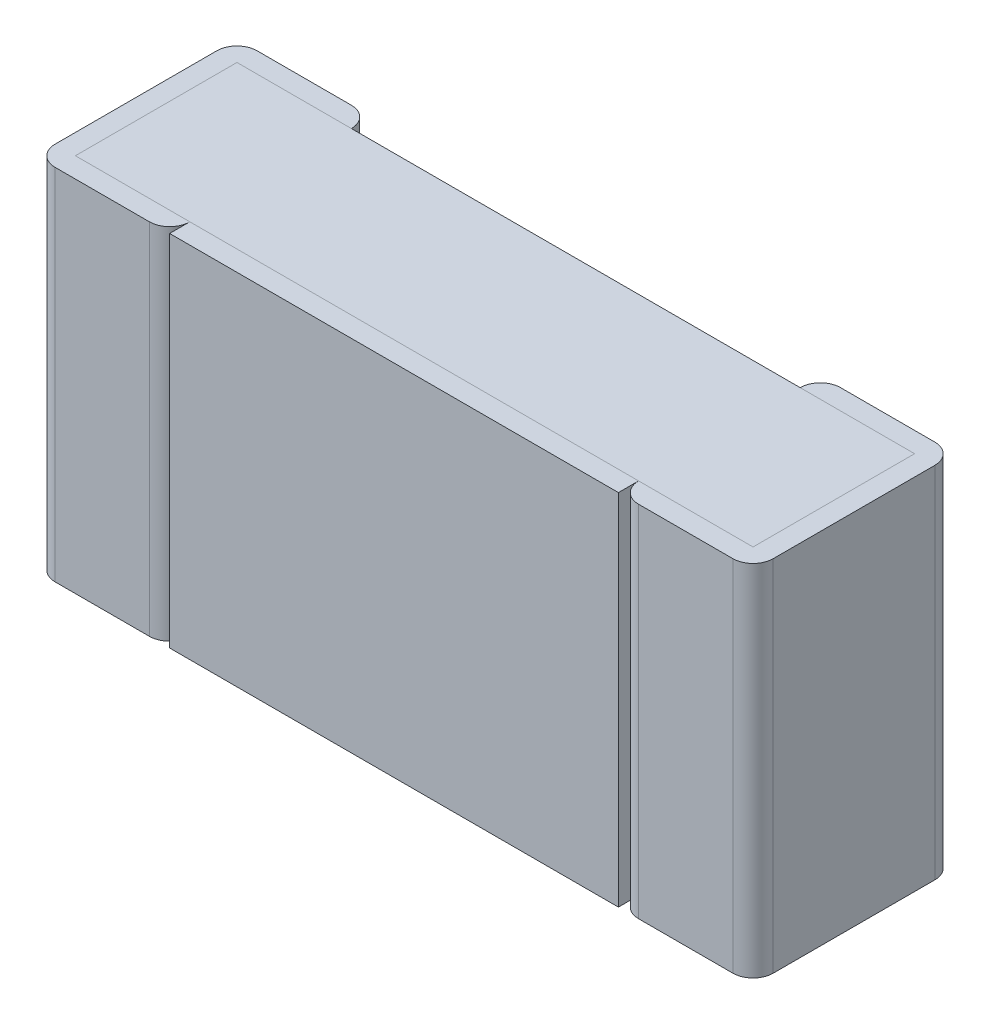
ISO-10303-21;
HEADER;
FILE_DESCRIPTION(('STEP AP214'),'2;1');
FILE_NAME('part.step','',(''),(''),'','','');
FILE_SCHEMA(('AUTOMOTIVE_DESIGN { 1 0 10303 214 1 1 1 1 }'));
ENDSEC;
DATA;
#1=APPLICATION_CONTEXT('core data for automotive mechanical design processes');
#2=APPLICATION_PROTOCOL_DEFINITION('international standard','automotive_design',2000,#1);
#3=PRODUCT_CONTEXT('',#1,'mechanical');
#4=PRODUCT('Part','Part','',(#3));
#5=PRODUCT_RELATED_PRODUCT_CATEGORY('part','',(#4));
#6=PRODUCT_DEFINITION_FORMATION('','',#4);
#7=PRODUCT_DEFINITION_CONTEXT('part definition',#1,'design');
#8=PRODUCT_DEFINITION('design','',#6,#7);
#9=PRODUCT_DEFINITION_SHAPE('','',#8);
#10=(LENGTH_UNIT() NAMED_UNIT(*) SI_UNIT(.MILLI.,.METRE.));
#11=(NAMED_UNIT(*) PLANE_ANGLE_UNIT() SI_UNIT($,.RADIAN.));
#12=(NAMED_UNIT(*) SI_UNIT($,.STERADIAN.) SOLID_ANGLE_UNIT());
#13=UNCERTAINTY_MEASURE_WITH_UNIT(LENGTH_MEASURE(1.E-05),#10,'distance_accuracy_value','');
#14=(GEOMETRIC_REPRESENTATION_CONTEXT(3) GLOBAL_UNCERTAINTY_ASSIGNED_CONTEXT((#13)) GLOBAL_UNIT_ASSIGNED_CONTEXT((#10,
#11,#12)) REPRESENTATION_CONTEXT('',''));
#15=CARTESIAN_POINT('',(0.,0.,0.));
#16=DIRECTION('',(0.,0.,1.));
#17=DIRECTION('',(1.,0.,0.));
#18=AXIS2_PLACEMENT_3D('',#15,#16,#17);
#19=CARTESIAN_POINT('',(136.568744279938,112.30804329235,112.661582908599));
#20=DIRECTION('',(0.,0.,1.));
#21=DIRECTION('',(1.,0.,0.));
#22=AXIS2_PLACEMENT_3D('',#19,#20,#21);
#23=PLANE('',#22);
#24=DIRECTION('',(0.,1.,0.));
#25=VECTOR('',#24,1.);
#26=CARTESIAN_POINT('',(136.568744279938,112.30804329235,112.661582908599));
#27=LINE('',#26,#25);
#28=CARTESIAN_POINT('',(136.568744279938,112.30804329235,112.661582908599));
#29=VERTEX_POINT('',#28);
#30=CARTESIAN_POINT('',(136.568744279938,113.10804329235,112.661582908599));
#31=VERTEX_POINT('',#30);
#32=EDGE_CURVE('E67',#29,#31,#27,.T.);
#33=ORIENTED_EDGE('',*,*,#32,.F.);
#34=DIRECTION('',(1.,0.,0.));
#35=VECTOR('',#34,1.);
#36=CARTESIAN_POINT('',(136.568744279938,112.30804329235,112.661582908599));
#37=LINE('',#36,#35);
#38=CARTESIAN_POINT('',(137.568744279938,112.30804329235,112.661582908599));
#39=VERTEX_POINT('',#38);
#40=EDGE_CURVE('E11',#29,#39,#37,.T.);
#41=ORIENTED_EDGE('',*,*,#40,.T.);
#42=DIRECTION('',(0.,1.,0.));
#43=VECTOR('',#42,1.);
#44=CARTESIAN_POINT('',(137.568744279938,112.30804329235,112.661582908599));
#45=LINE('',#44,#43);
#46=CARTESIAN_POINT('',(137.568744279938,113.10804329235,112.661582908599));
#47=VERTEX_POINT('',#46);
#48=EDGE_CURVE('E55',#39,#47,#45,.T.);
#49=ORIENTED_EDGE('',*,*,#48,.T.);
#50=DIRECTION('',(1.,0.,0.));
#51=VECTOR('',#50,1.);
#52=CARTESIAN_POINT('',(136.568744279938,113.10804329235,112.661582908599));
#53=LINE('',#52,#51);
#54=EDGE_CURVE('E281',#31,#47,#53,.T.);
#55=ORIENTED_EDGE('',*,*,#54,.F.);
#56=EDGE_LOOP('',(#33,#41,#49,#55));
#57=FACE_BOUND('',#56,.T.);
#58=ADVANCED_FACE('F44',(#57),#23,.T.);
#59=CARTESIAN_POINT('',(137.568744279938,112.30804329235,112.616582908599));
#60=DIRECTION('',(1.,0.,0.));
#61=DIRECTION('',(0.,1.,0.));
#62=AXIS2_PLACEMENT_3D('',#59,#60,#61);
#63=PLANE('',#62);
#64=DIRECTION('',(0.,0.,1.));
#65=VECTOR('',#64,1.);
#66=CARTESIAN_POINT('',(137.568744279938,112.30804329235,112.616582908599));
#67=LINE('',#66,#65);
#68=CARTESIAN_POINT('',(137.568744279938,112.30804329235,112.616582908599));
#69=VERTEX_POINT('',#68);
#70=EDGE_CURVE('E471',#69,#39,#67,.T.);
#71=ORIENTED_EDGE('',*,*,#70,.F.);
#72=DIRECTION('',(0.,1.,0.));
#73=VECTOR('',#72,1.);
#74=CARTESIAN_POINT('',(137.568744279938,112.30804329235,112.616582908599));
#75=LINE('',#74,#73);
#76=CARTESIAN_POINT('',(137.568744279938,113.10804329235,112.616582908599));
#77=VERTEX_POINT('',#76);
#78=EDGE_CURVE('E396',#69,#77,#75,.T.);
#79=ORIENTED_EDGE('',*,*,#78,.T.);
#80=DIRECTION('',(0.,0.,1.));
#81=VECTOR('',#80,1.);
#82=CARTESIAN_POINT('',(137.568744279938,113.10804329235,112.616582908599));
#83=LINE('',#82,#81);
#84=EDGE_CURVE('E394',#77,#47,#83,.T.);
#85=ORIENTED_EDGE('',*,*,#84,.T.);
#86=ORIENTED_EDGE('',*,*,#48,.F.);
#87=EDGE_LOOP('',(#71,#79,#85,#86));
#88=FACE_BOUND('',#87,.T.);
#89=ADVANCED_FACE('F529',(#88),#63,.T.);
#90=CARTESIAN_POINT('',(137.613744279938,112.30804329235,112.616582908599));
#91=DIRECTION('',(0.,1.,0.));
#92=DIRECTION('',(-1.,0.,0.));
#93=AXIS2_PLACEMENT_3D('',#90,#91,#92);
#94=CYLINDRICAL_SURFACE('',#93,0.0449999999999895);
#95=CARTESIAN_POINT('',(137.613744279938,112.30804329235,112.616582908599));
#96=DIRECTION('',(0.,1.,0.));
#97=DIRECTION('',(0.,0.,1.));
#98=AXIS2_PLACEMENT_3D('',#95,#96,#97);
#99=CIRCLE('',#98,0.0450000000000034);
#100=CARTESIAN_POINT('',(137.613744279938,112.30804329235,112.661582908599));
#101=VERTEX_POINT('',#100);
#102=EDGE_CURVE('E397',#69,#101,#99,.T.);
#103=ORIENTED_EDGE('',*,*,#102,.T.);
#104=DIRECTION('',(0.,1.,0.));
#105=VECTOR('',#104,1.);
#106=CARTESIAN_POINT('',(137.613744279938,112.30804329235,112.661582908599));
#107=LINE('',#106,#105);
#108=CARTESIAN_POINT('',(137.613744279938,113.10804329235,112.661582908599));
#109=VERTEX_POINT('',#108);
#110=EDGE_CURVE('E402',#101,#109,#107,.T.);
#111=ORIENTED_EDGE('',*,*,#110,.T.);
#112=CARTESIAN_POINT('',(137.613744279938,113.10804329235,112.616582908599));
#113=DIRECTION('',(0.,1.,0.));
#114=DIRECTION('',(0.,0.,1.));
#115=AXIS2_PLACEMENT_3D('',#112,#113,#114);
#116=CIRCLE('',#115,0.0450000000000034);
#117=EDGE_CURVE('E390',#77,#109,#116,.T.);
#118=ORIENTED_EDGE('',*,*,#117,.F.);
#119=ORIENTED_EDGE('',*,*,#78,.F.);
#120=EDGE_LOOP('',(#103,#111,#118,#119));
#121=FACE_BOUND('',#120,.T.);
#122=ADVANCED_FACE('F533',(#121),#94,.T.);
#123=CARTESIAN_POINT('',(137.568744279938,112.30804329235,112.661582908599));
#124=DIRECTION('',(0.,0.,1.));
#125=DIRECTION('',(1.,0.,0.));
#126=AXIS2_PLACEMENT_3D('',#123,#124,#125);
#127=PLANE('',#126);
#128=DIRECTION('',(1.,0.,0.));
#129=VECTOR('',#128,1.);
#130=CARTESIAN_POINT('',(137.568744279938,113.10804329235,112.661582908599));
#131=LINE('',#130,#129);
#132=CARTESIAN_POINT('',(137.823744279938,113.10804329235,112.661582908599));
#133=VERTEX_POINT('',#132);
#134=EDGE_CURVE('E416',#109,#133,#131,.T.);
#135=ORIENTED_EDGE('',*,*,#134,.F.);
#136=ORIENTED_EDGE('',*,*,#110,.F.);
#137=DIRECTION('',(1.,0.,0.));
#138=VECTOR('',#137,1.);
#139=CARTESIAN_POINT('',(137.568744279938,112.30804329235,112.661582908599));
#140=LINE('',#139,#138);
#141=CARTESIAN_POINT('',(137.823744279938,112.30804329235,112.661582908599));
#142=VERTEX_POINT('',#141);
#143=EDGE_CURVE('E427',#101,#142,#140,.T.);
#144=ORIENTED_EDGE('',*,*,#143,.T.);
#145=DIRECTION('',(0.,1.,0.));
#146=VECTOR('',#145,1.);
#147=CARTESIAN_POINT('',(137.823744279938,112.30804329235,112.661582908599));
#148=LINE('',#147,#146);
#149=EDGE_CURVE('E423',#142,#133,#148,.T.);
#150=ORIENTED_EDGE('',*,*,#149,.T.);
#151=EDGE_LOOP('',(#135,#136,#144,#150));
#152=FACE_BOUND('',#151,.T.);
#153=ADVANCED_FACE('F541',(#152),#127,.T.);
#154=CARTESIAN_POINT('',(137.823744279938,112.30804329235,112.616582908599));
#155=DIRECTION('',(0.,1.,0.));
#156=DIRECTION('',(1.,0.,0.));
#157=AXIS2_PLACEMENT_3D('',#154,#155,#156);
#158=CYLINDRICAL_SURFACE('',#157,0.0449999999999895);
#159=DIRECTION('',(0.,1.,0.));
#160=VECTOR('',#159,1.);
#161=CARTESIAN_POINT('',(137.868744279938,112.30804329235,112.616582908599));
#162=LINE('',#161,#160);
#163=CARTESIAN_POINT('',(137.868744279938,112.30804329235,112.616582908599));
#164=VERTEX_POINT('',#163);
#165=CARTESIAN_POINT('',(137.868744279938,113.10804329235,112.616582908599));
#166=VERTEX_POINT('',#165);
#167=EDGE_CURVE('E318',#164,#166,#162,.T.);
#168=ORIENTED_EDGE('',*,*,#167,.T.);
#169=CARTESIAN_POINT('',(137.823744279938,113.10804329235,112.616582908599));
#170=DIRECTION('',(0.,-1.,0.));
#171=DIRECTION('',(0.,0.,1.));
#172=AXIS2_PLACEMENT_3D('',#169,#170,#171);
#173=CIRCLE('',#172,0.0450000000000034);
#174=EDGE_CURVE('E314',#166,#133,#173,.T.);
#175=ORIENTED_EDGE('',*,*,#174,.T.);
#176=ORIENTED_EDGE('',*,*,#149,.F.);
#177=CARTESIAN_POINT('',(137.823744279938,112.30804329235,112.616582908599));
#178=DIRECTION('',(0.,-1.,0.));
#179=DIRECTION('',(0.,0.,1.));
#180=AXIS2_PLACEMENT_3D('',#177,#178,#179);
#181=CIRCLE('',#180,0.0450000000000034);
#182=EDGE_CURVE('E327',#164,#142,#181,.T.);
#183=ORIENTED_EDGE('',*,*,#182,.F.);
#184=EDGE_LOOP('',(#168,#175,#176,#183));
#185=FACE_BOUND('',#184,.T.);
#186=ADVANCED_FACE('F544',(#185),#158,.T.);
#187=CARTESIAN_POINT('',(137.868744279938,112.30804329235,112.211582908599));
#188=DIRECTION('',(1.,0.,0.));
#189=DIRECTION('',(0.,1.,0.));
#190=AXIS2_PLACEMENT_3D('',#187,#188,#189);
#191=PLANE('',#190);
#192=DIRECTION('',(0.,0.,1.));
#193=VECTOR('',#192,1.);
#194=CARTESIAN_POINT('',(137.868744279938,112.30804329235,112.211582908599));
#195=LINE('',#194,#193);
#196=CARTESIAN_POINT('',(137.868744279938,112.30804329235,112.256582908599));
#197=VERTEX_POINT('',#196);
#198=EDGE_CURVE('E323',#197,#164,#195,.T.);
#199=ORIENTED_EDGE('',*,*,#198,.F.);
#200=DIRECTION('',(0.,1.,0.));
#201=VECTOR('',#200,1.);
#202=CARTESIAN_POINT('',(137.868744279938,112.30804329235,112.256582908599));
#203=LINE('',#202,#201);
#204=CARTESIAN_POINT('',(137.868744279938,113.10804329235,112.256582908599));
#205=VERTEX_POINT('',#204);
#206=EDGE_CURVE('E319',#197,#205,#203,.T.);
#207=ORIENTED_EDGE('',*,*,#206,.T.);
#208=DIRECTION('',(0.,0.,1.));
#209=VECTOR('',#208,1.);
#210=CARTESIAN_POINT('',(137.868744279938,113.10804329235,112.211582908599));
#211=LINE('',#210,#209);
#212=EDGE_CURVE('E387',#205,#166,#211,.T.);
#213=ORIENTED_EDGE('',*,*,#212,.T.);
#214=ORIENTED_EDGE('',*,*,#167,.F.);
#215=EDGE_LOOP('',(#199,#207,#213,#214));
#216=FACE_BOUND('',#215,.T.);
#217=ADVANCED_FACE('F546',(#216),#191,.T.);
#218=CARTESIAN_POINT('',(137.823744279938,112.30804329235,112.256582908599));
#219=DIRECTION('',(0.,1.,0.));
#220=DIRECTION('',(1.,0.,0.));
#221=AXIS2_PLACEMENT_3D('',#218,#219,#220);
#222=CYLINDRICAL_SURFACE('',#221,0.0449999999999895);
#223=CARTESIAN_POINT('',(137.823744279938,112.30804329235,112.256582908599));
#224=DIRECTION('',(0.,1.,0.));
#225=DIRECTION('',(0.,0.,1.));
#226=AXIS2_PLACEMENT_3D('',#223,#224,#225);
#227=CIRCLE('',#226,0.0450000000000034);
#228=CARTESIAN_POINT('',(137.823744279938,112.30804329235,112.211582908599));
#229=VERTEX_POINT('',#228);
#230=EDGE_CURVE('E361',#197,#229,#227,.T.);
#231=ORIENTED_EDGE('',*,*,#230,.T.);
#232=DIRECTION('',(0.,1.,0.));
#233=VECTOR('',#232,1.);
#234=CARTESIAN_POINT('',(137.823744279938,112.30804329235,112.211582908599));
#235=LINE('',#234,#233);
#236=CARTESIAN_POINT('',(137.823744279938,113.10804329235,112.211582908599));
#237=VERTEX_POINT('',#236);
#238=EDGE_CURVE('E357',#229,#237,#235,.T.);
#239=ORIENTED_EDGE('',*,*,#238,.T.);
#240=CARTESIAN_POINT('',(137.823744279938,113.10804329235,112.256582908599));
#241=DIRECTION('',(0.,1.,0.));
#242=DIRECTION('',(0.,0.,1.));
#243=AXIS2_PLACEMENT_3D('',#240,#241,#242);
#244=CIRCLE('',#243,0.0450000000000034);
#245=EDGE_CURVE('E278',#205,#237,#244,.T.);
#246=ORIENTED_EDGE('',*,*,#245,.F.);
#247=ORIENTED_EDGE('',*,*,#206,.F.);
#248=EDGE_LOOP('',(#231,#239,#246,#247));
#249=FACE_BOUND('',#248,.T.);
#250=ADVANCED_FACE('F506',(#249),#222,.T.);
#251=CARTESIAN_POINT('',(137.568744279938,112.30804329235,112.211582908599));
#252=DIRECTION('',(0.,0.,1.));
#253=DIRECTION('',(1.,0.,0.));
#254=AXIS2_PLACEMENT_3D('',#251,#252,#253);
#255=PLANE('',#254);
#256=ORIENTED_EDGE('',*,*,#238,.F.);
#257=DIRECTION('',(1.,0.,0.));
#258=VECTOR('',#257,1.);
#259=CARTESIAN_POINT('',(137.568744279938,112.30804329235,112.211582908599));
#260=LINE('',#259,#258);
#261=CARTESIAN_POINT('',(137.613744279938,112.30804329235,112.211582908599));
#262=VERTEX_POINT('',#261);
#263=EDGE_CURVE('E408',#262,#229,#260,.T.);
#264=ORIENTED_EDGE('',*,*,#263,.F.);
#265=DIRECTION('',(0.,1.,0.));
#266=VECTOR('',#265,1.);
#267=CARTESIAN_POINT('',(137.613744279938,112.30804329235,112.211582908599));
#268=LINE('',#267,#266);
#269=CARTESIAN_POINT('',(137.613744279938,113.10804329235,112.211582908599));
#270=VERTEX_POINT('',#269);
#271=EDGE_CURVE('E338',#262,#270,#268,.T.);
#272=ORIENTED_EDGE('',*,*,#271,.T.);
#273=DIRECTION('',(1.,0.,0.));
#274=VECTOR('',#273,1.);
#275=CARTESIAN_POINT('',(137.568744279938,113.10804329235,112.211582908599));
#276=LINE('',#275,#274);
#277=EDGE_CURVE('E140',#270,#237,#276,.T.);
#278=ORIENTED_EDGE('',*,*,#277,.T.);
#279=EDGE_LOOP('',(#256,#264,#272,#278));
#280=FACE_BOUND('',#279,.T.);
#281=ADVANCED_FACE('F509',(#280),#255,.F.);
#282=CARTESIAN_POINT('',(137.613744279938,112.30804329235,112.256582908599));
#283=DIRECTION('',(0.,1.,0.));
#284=DIRECTION('',(-1.,0.,0.));
#285=AXIS2_PLACEMENT_3D('',#282,#283,#284);
#286=CYLINDRICAL_SURFACE('',#285,0.0449999999999895);
#287=DIRECTION('',(0.,1.,0.));
#288=VECTOR('',#287,1.);
#289=CARTESIAN_POINT('',(137.568744279938,112.30804329235,112.256582908599));
#290=LINE('',#289,#288);
#291=CARTESIAN_POINT('',(137.568744279938,112.30804329235,112.256582908599));
#292=VERTEX_POINT('',#291);
#293=CARTESIAN_POINT('',(137.568744279938,113.10804329235,112.256582908599));
#294=VERTEX_POINT('',#293);
#295=EDGE_CURVE('E295',#292,#294,#290,.T.);
#296=ORIENTED_EDGE('',*,*,#295,.T.);
#297=CARTESIAN_POINT('',(137.613744279938,113.10804329235,112.256582908599));
#298=DIRECTION('',(0.,-1.,0.));
#299=DIRECTION('',(0.,0.,1.));
#300=AXIS2_PLACEMENT_3D('',#297,#298,#299);
#301=CIRCLE('',#300,0.0450000000000034);
#302=EDGE_CURVE('E288',#294,#270,#301,.T.);
#303=ORIENTED_EDGE('',*,*,#302,.T.);
#304=ORIENTED_EDGE('',*,*,#271,.F.);
#305=CARTESIAN_POINT('',(137.613744279938,112.30804329235,112.256582908599));
#306=DIRECTION('',(0.,-1.,0.));
#307=DIRECTION('',(0.,0.,1.));
#308=AXIS2_PLACEMENT_3D('',#305,#306,#307);
#309=CIRCLE('',#308,0.0450000000000034);
#310=EDGE_CURVE('E403',#292,#262,#309,.T.);
#311=ORIENTED_EDGE('',*,*,#310,.F.);
#312=EDGE_LOOP('',(#296,#303,#304,#311));
#313=FACE_BOUND('',#312,.T.);
#314=ADVANCED_FACE('F513',(#313),#286,.T.);
#315=CARTESIAN_POINT('',(136.568744279938,113.10804329235,112.616582908599));
#316=DIRECTION('',(0.,1.,0.));
#317=DIRECTION('',(1.,0.,0.));
#318=AXIS2_PLACEMENT_3D('',#315,#316,#317);
#319=PLANE('',#318);
#320=DIRECTION('',(1.,0.,0.));
#321=VECTOR('',#320,1.);
#322=CARTESIAN_POINT('',(136.568744279938,113.10804329235,112.616582908599));
#323=LINE('',#322,#321);
#324=CARTESIAN_POINT('',(136.568744279938,113.10804329235,112.616582908599));
#325=VERTEX_POINT('',#324);
#326=EDGE_CURVE('E258',#325,#77,#323,.T.);
#327=ORIENTED_EDGE('',*,*,#326,.F.);
#328=DIRECTION('',(0.,0.,1.));
#329=VECTOR('',#328,1.);
#330=CARTESIAN_POINT('',(136.568744279938,113.10804329235,112.616582908599));
#331=LINE('',#330,#329);
#332=EDGE_CURVE('E275',#325,#31,#331,.T.);
#333=ORIENTED_EDGE('',*,*,#332,.T.);
#334=ORIENTED_EDGE('',*,*,#54,.T.);
#335=ORIENTED_EDGE('',*,*,#84,.F.);
#336=EDGE_LOOP('',(#327,#333,#334,#335));
#337=FACE_BOUND('',#336,.T.);
#338=ADVANCED_FACE('F46',(#337),#319,.T.);
#339=CARTESIAN_POINT('',(137.568744279938,113.10804329235,112.211582908599));
#340=DIRECTION('',(0.,1.,0.));
#341=DIRECTION('',(1.,0.,0.));
#342=AXIS2_PLACEMENT_3D('',#339,#340,#341);
#343=PLANE('',#342);
#344=ORIENTED_EDGE('',*,*,#277,.F.);
#345=ORIENTED_EDGE('',*,*,#302,.F.);
#346=DIRECTION('',(1.,0.,0.));
#347=VECTOR('',#346,1.);
#348=CARTESIAN_POINT('',(136.313744279938,113.10804329235,112.256582908599));
#349=LINE('',#348,#347);
#350=CARTESIAN_POINT('',(137.823744279938,113.10804329235,112.256582908599));
#351=VERTEX_POINT('',#350);
#352=EDGE_CURVE('E129',#294,#351,#349,.T.);
#353=ORIENTED_EDGE('',*,*,#352,.T.);
#354=DIRECTION('',(0.,0.,1.));
#355=VECTOR('',#354,1.);
#356=CARTESIAN_POINT('',(137.823744279938,113.10804329235,112.256582908599));
#357=LINE('',#356,#355);
#358=CARTESIAN_POINT('',(137.823744279938,113.10804329235,112.616582908599));
#359=VERTEX_POINT('',#358);
#360=EDGE_CURVE('E330',#351,#359,#357,.T.);
#361=ORIENTED_EDGE('',*,*,#360,.T.);
#362=DIRECTION('',(1.,0.,0.));
#363=VECTOR('',#362,1.);
#364=CARTESIAN_POINT('',(136.313744279938,113.10804329235,112.616582908599));
#365=LINE('',#364,#363);
#366=EDGE_CURVE('E371',#77,#359,#365,.T.);
#367=ORIENTED_EDGE('',*,*,#366,.F.);
#368=ORIENTED_EDGE('',*,*,#117,.T.);
#369=ORIENTED_EDGE('',*,*,#134,.T.);
#370=ORIENTED_EDGE('',*,*,#174,.F.);
#371=ORIENTED_EDGE('',*,*,#212,.F.);
#372=ORIENTED_EDGE('',*,*,#245,.T.);
#373=EDGE_LOOP('',(#344,#345,#353,#361,#367,#368,#369,#370,#371,#372));
#374=FACE_BOUND('',#373,.T.);
#375=ADVANCED_FACE('F503',(#374),#343,.T.);
#376=CARTESIAN_POINT('',(136.568744279938,112.30804329235,112.616582908599));
#377=DIRECTION('',(1.,0.,0.));
#378=DIRECTION('',(0.,1.,0.));
#379=AXIS2_PLACEMENT_3D('',#376,#377,#378);
#380=PLANE('',#379);
#381=ORIENTED_EDGE('',*,*,#32,.T.);
#382=ORIENTED_EDGE('',*,*,#332,.F.);
#383=DIRECTION('',(0.,1.,0.));
#384=VECTOR('',#383,1.);
#385=CARTESIAN_POINT('',(136.568744279938,112.30804329235,112.616582908599));
#386=LINE('',#385,#384);
#387=CARTESIAN_POINT('',(136.568744279938,112.30804329235,112.616582908599));
#388=VERTEX_POINT('',#387);
#389=EDGE_CURVE('E368',#388,#325,#386,.T.);
#390=ORIENTED_EDGE('',*,*,#389,.F.);
#391=DIRECTION('',(0.,0.,1.));
#392=VECTOR('',#391,1.);
#393=CARTESIAN_POINT('',(136.568744279938,112.30804329235,112.616582908599));
#394=LINE('',#393,#392);
#395=EDGE_CURVE('E48',#388,#29,#394,.T.);
#396=ORIENTED_EDGE('',*,*,#395,.T.);
#397=EDGE_LOOP('',(#381,#382,#390,#396));
#398=FACE_BOUND('',#397,.T.);
#399=ADVANCED_FACE('F272',(#398),#380,.F.);
#400=CARTESIAN_POINT('',(136.568744279938,112.30804329235,112.616582908599));
#401=DIRECTION('',(0.,1.,0.));
#402=DIRECTION('',(1.,0.,0.));
#403=AXIS2_PLACEMENT_3D('',#400,#401,#402);
#404=PLANE('',#403);
#405=ORIENTED_EDGE('',*,*,#70,.T.);
#406=ORIENTED_EDGE('',*,*,#40,.F.);
#407=ORIENTED_EDGE('',*,*,#395,.F.);
#408=DIRECTION('',(1.,0.,0.));
#409=VECTOR('',#408,1.);
#410=CARTESIAN_POINT('',(136.568744279938,112.30804329235,112.616582908599));
#411=LINE('',#410,#409);
#412=EDGE_CURVE('E266',#388,#69,#411,.T.);
#413=ORIENTED_EDGE('',*,*,#412,.T.);
#414=EDGE_LOOP('',(#405,#406,#407,#413));
#415=FACE_BOUND('',#414,.T.);
#416=ADVANCED_FACE('F603',(#415),#404,.F.);
#417=CARTESIAN_POINT('',(137.568744279938,112.30804329235,112.211582908599));
#418=DIRECTION('',(0.,1.,0.));
#419=DIRECTION('',(1.,0.,0.));
#420=AXIS2_PLACEMENT_3D('',#417,#418,#419);
#421=PLANE('',#420);
#422=ORIENTED_EDGE('',*,*,#230,.F.);
#423=ORIENTED_EDGE('',*,*,#198,.T.);
#424=ORIENTED_EDGE('',*,*,#182,.T.);
#425=ORIENTED_EDGE('',*,*,#143,.F.);
#426=ORIENTED_EDGE('',*,*,#102,.F.);
#427=DIRECTION('',(1.,0.,0.));
#428=VECTOR('',#427,1.);
#429=CARTESIAN_POINT('',(136.313744279938,112.30804329235,112.616582908599));
#430=LINE('',#429,#428);
#431=CARTESIAN_POINT('',(137.823744279938,112.30804329235,112.616582908599));
#432=VERTEX_POINT('',#431);
#433=EDGE_CURVE('E407',#69,#432,#430,.T.);
#434=ORIENTED_EDGE('',*,*,#433,.T.);
#435=DIRECTION('',(0.,0.,1.));
#436=VECTOR('',#435,1.);
#437=CARTESIAN_POINT('',(137.823744279938,112.30804329235,112.256582908599));
#438=LINE('',#437,#436);
#439=CARTESIAN_POINT('',(137.823744279938,112.30804329235,112.256582908599));
#440=VERTEX_POINT('',#439);
#441=EDGE_CURVE('E334',#440,#432,#438,.T.);
#442=ORIENTED_EDGE('',*,*,#441,.F.);
#443=DIRECTION('',(1.,0.,0.));
#444=VECTOR('',#443,1.);
#445=CARTESIAN_POINT('',(136.313744279938,112.30804329235,112.256582908599));
#446=LINE('',#445,#444);
#447=EDGE_CURVE('E353',#292,#440,#446,.T.);
#448=ORIENTED_EDGE('',*,*,#447,.F.);
#449=ORIENTED_EDGE('',*,*,#310,.T.);
#450=ORIENTED_EDGE('',*,*,#263,.T.);
#451=EDGE_LOOP('',(#422,#423,#424,#425,#426,#434,#442,#448,#449,#450));
#452=FACE_BOUND('',#451,.T.);
#453=ADVANCED_FACE('F538',(#452),#421,.F.);
#454=CARTESIAN_POINT('',(136.313744279938,112.30804329235,112.256582908599));
#455=DIRECTION('',(0.,0.,1.));
#456=DIRECTION('',(1.,0.,0.));
#457=AXIS2_PLACEMENT_3D('',#454,#455,#456);
#458=PLANE('',#457);
#459=DIRECTION('',(1.,0.,0.));
#460=VECTOR('',#459,1.);
#461=CARTESIAN_POINT('',(136.313744279938,113.10804329235,112.256582908599));
#462=LINE('',#461,#460);
#463=CARTESIAN_POINT('',(136.568744279938,113.10804329235,112.256582908599));
#464=VERTEX_POINT('',#463);
#465=EDGE_CURVE('E366',#464,#294,#462,.T.);
#466=ORIENTED_EDGE('',*,*,#465,.T.);
#467=ORIENTED_EDGE('',*,*,#295,.F.);
#468=DIRECTION('',(1.,0.,0.));
#469=VECTOR('',#468,1.);
#470=CARTESIAN_POINT('',(136.313744279938,112.30804329235,112.256582908599));
#471=LINE('',#470,#469);
#472=CARTESIAN_POINT('',(136.568744279938,112.30804329235,112.256582908599));
#473=VERTEX_POINT('',#472);
#474=EDGE_CURVE('E304',#473,#292,#471,.T.);
#475=ORIENTED_EDGE('',*,*,#474,.F.);
#476=DIRECTION('',(0.,1.,0.));
#477=VECTOR('',#476,1.);
#478=CARTESIAN_POINT('',(136.568744279938,112.30804329235,112.256582908599));
#479=LINE('',#478,#477);
#480=EDGE_CURVE('E362',#473,#464,#479,.T.);
#481=ORIENTED_EDGE('',*,*,#480,.T.);
#482=EDGE_LOOP('',(#466,#467,#475,#481));
#483=FACE_BOUND('',#482,.T.);
#484=ADVANCED_FACE('F549',(#483),#458,.F.);
#485=CARTESIAN_POINT('',(136.313744279938,113.10804329235,112.256582908599));
#486=DIRECTION('',(0.,1.,0.));
#487=DIRECTION('',(1.,0.,0.));
#488=AXIS2_PLACEMENT_3D('',#485,#486,#487);
#489=PLANE('',#488);
#490=DIRECTION('',(1.,0.,0.));
#491=VECTOR('',#490,1.);
#492=CARTESIAN_POINT('',(136.313744279938,113.10804329235,112.256582908599));
#493=LINE('',#492,#491);
#494=CARTESIAN_POINT('',(136.313744279938,113.10804329235,112.256582908599));
#495=VERTEX_POINT('',#494);
#496=EDGE_CURVE('E391',#495,#464,#493,.T.);
#497=ORIENTED_EDGE('',*,*,#496,.F.);
#498=DIRECTION('',(0.,0.,1.));
#499=VECTOR('',#498,1.);
#500=CARTESIAN_POINT('',(136.313744279938,113.10804329235,112.256582908599));
#501=LINE('',#500,#499);
#502=CARTESIAN_POINT('',(136.313744279938,113.10804329235,112.616582908599));
#503=VERTEX_POINT('',#502);
#504=EDGE_CURVE('E367',#495,#503,#501,.T.);
#505=ORIENTED_EDGE('',*,*,#504,.T.);
#506=DIRECTION('',(1.,0.,0.));
#507=VECTOR('',#506,1.);
#508=CARTESIAN_POINT('',(136.313744279938,113.10804329235,112.616582908599));
#509=LINE('',#508,#507);
#510=EDGE_CURVE('E462',#503,#325,#509,.T.);
#511=ORIENTED_EDGE('',*,*,#510,.T.);
#512=ORIENTED_EDGE('',*,*,#326,.T.);
#513=ORIENTED_EDGE('',*,*,#366,.T.);
#514=ORIENTED_EDGE('',*,*,#360,.F.);
#515=ORIENTED_EDGE('',*,*,#352,.F.);
#516=ORIENTED_EDGE('',*,*,#465,.F.);
#517=EDGE_LOOP('',(#497,#505,#511,#512,#513,#514,#515,#516));
#518=FACE_BOUND('',#517,.T.);
#519=ADVANCED_FACE('F516',(#518),#489,.T.);
#520=CARTESIAN_POINT('',(136.523744279938,112.30804329235,112.616582908599));
#521=DIRECTION('',(0.,1.,0.));
#522=DIRECTION('',(1.,0.,0.));
#523=AXIS2_PLACEMENT_3D('',#520,#521,#522);
#524=CYLINDRICAL_SURFACE('',#523,0.0449999999999895);
#525=ORIENTED_EDGE('',*,*,#389,.T.);
#526=CARTESIAN_POINT('',(136.523744279938,113.10804329235,112.616582908599));
#527=DIRECTION('',(0.,-1.,0.));
#528=DIRECTION('',(0.,0.,1.));
#529=AXIS2_PLACEMENT_3D('',#526,#527,#528);
#530=CIRCLE('',#529,0.0450000000000034);
#531=CARTESIAN_POINT('',(136.523744279938,113.10804329235,112.661582908599));
#532=VERTEX_POINT('',#531);
#533=EDGE_CURVE('E372',#325,#532,#530,.T.);
#534=ORIENTED_EDGE('',*,*,#533,.T.);
#535=DIRECTION('',(0.,1.,0.));
#536=VECTOR('',#535,1.);
#537=CARTESIAN_POINT('',(136.523744279938,112.30804329235,112.661582908599));
#538=LINE('',#537,#536);
#539=CARTESIAN_POINT('',(136.523744279938,112.30804329235,112.661582908599));
#540=VERTEX_POINT('',#539);
#541=EDGE_CURVE('E301',#540,#532,#538,.T.);
#542=ORIENTED_EDGE('',*,*,#541,.F.);
#543=CARTESIAN_POINT('',(136.523744279938,112.30804329235,112.616582908599));
#544=DIRECTION('',(0.,-1.,0.));
#545=DIRECTION('',(0.,0.,1.));
#546=AXIS2_PLACEMENT_3D('',#543,#544,#545);
#547=CIRCLE('',#546,0.0450000000000034);
#548=EDGE_CURVE('E305',#388,#540,#547,.T.);
#549=ORIENTED_EDGE('',*,*,#548,.F.);
#550=EDGE_LOOP('',(#525,#534,#542,#549));
#551=FACE_BOUND('',#550,.T.);
#552=ADVANCED_FACE('F564',(#551),#524,.T.);
#553=CARTESIAN_POINT('',(136.268744279938,112.30804329235,112.661582908599));
#554=DIRECTION('',(0.,0.,1.));
#555=DIRECTION('',(1.,0.,0.));
#556=AXIS2_PLACEMENT_3D('',#553,#554,#555);
#557=PLANE('',#556);
#558=DIRECTION('',(1.,0.,0.));
#559=VECTOR('',#558,1.);
#560=CARTESIAN_POINT('',(136.268744279938,113.10804329235,112.661582908599));
#561=LINE('',#560,#559);
#562=CARTESIAN_POINT('',(136.313744279938,113.10804329235,112.661582908599));
#563=VERTEX_POINT('',#562);
#564=EDGE_CURVE('E380',#563,#532,#561,.T.);
#565=ORIENTED_EDGE('',*,*,#564,.F.);
#566=DIRECTION('',(0.,1.,0.));
#567=VECTOR('',#566,1.);
#568=CARTESIAN_POINT('',(136.313744279938,112.30804329235,112.661582908599));
#569=LINE('',#568,#567);
#570=CARTESIAN_POINT('',(136.313744279938,112.30804329235,112.661582908599));
#571=VERTEX_POINT('',#570);
#572=EDGE_CURVE('E204',#571,#563,#569,.T.);
#573=ORIENTED_EDGE('',*,*,#572,.F.);
#574=DIRECTION('',(1.,0.,0.));
#575=VECTOR('',#574,1.);
#576=CARTESIAN_POINT('',(136.268744279938,112.30804329235,112.661582908599));
#577=LINE('',#576,#575);
#578=EDGE_CURVE('E303',#571,#540,#577,.T.);
#579=ORIENTED_EDGE('',*,*,#578,.T.);
#580=ORIENTED_EDGE('',*,*,#541,.T.);
#581=EDGE_LOOP('',(#565,#573,#579,#580));
#582=FACE_BOUND('',#581,.T.);
#583=ADVANCED_FACE('F611',(#582),#557,.T.);
#584=CARTESIAN_POINT('',(136.313744279938,112.30804329235,112.256582908599));
#585=DIRECTION('',(0.,1.,0.));
#586=DIRECTION('',(1.,0.,0.));
#587=AXIS2_PLACEMENT_3D('',#584,#585,#586);
#588=PLANE('',#587);
#589=ORIENTED_EDGE('',*,*,#474,.T.);
#590=ORIENTED_EDGE('',*,*,#447,.T.);
#591=ORIENTED_EDGE('',*,*,#441,.T.);
#592=ORIENTED_EDGE('',*,*,#433,.F.);
#593=ORIENTED_EDGE('',*,*,#412,.F.);
#594=DIRECTION('',(1.,0.,0.));
#595=VECTOR('',#594,1.);
#596=CARTESIAN_POINT('',(136.313744279938,112.30804329235,112.616582908599));
#597=LINE('',#596,#595);
#598=CARTESIAN_POINT('',(136.313744279938,112.30804329235,112.616582908599));
#599=VERTEX_POINT('',#598);
#600=EDGE_CURVE('E308',#599,#388,#597,.T.);
#601=ORIENTED_EDGE('',*,*,#600,.F.);
#602=DIRECTION('',(0.,0.,1.));
#603=VECTOR('',#602,1.);
#604=CARTESIAN_POINT('',(136.313744279938,112.30804329235,112.256582908599));
#605=LINE('',#604,#603);
#606=CARTESIAN_POINT('',(136.313744279938,112.30804329235,112.256582908599));
#607=VERTEX_POINT('',#606);
#608=EDGE_CURVE('E375',#607,#599,#605,.T.);
#609=ORIENTED_EDGE('',*,*,#608,.F.);
#610=DIRECTION('',(1.,0.,0.));
#611=VECTOR('',#610,1.);
#612=CARTESIAN_POINT('',(136.313744279938,112.30804329235,112.256582908599));
#613=LINE('',#612,#611);
#614=EDGE_CURVE('E331',#607,#473,#613,.T.);
#615=ORIENTED_EDGE('',*,*,#614,.T.);
#616=EDGE_LOOP('',(#589,#590,#591,#592,#593,#601,#609,#615));
#617=FACE_BOUND('',#616,.T.);
#618=ADVANCED_FACE('F536',(#617),#588,.F.);
#619=CARTESIAN_POINT('',(136.523744279938,112.30804329235,112.256582908599));
#620=DIRECTION('',(0.,1.,0.));
#621=DIRECTION('',(1.,0.,0.));
#622=AXIS2_PLACEMENT_3D('',#619,#620,#621);
#623=CYLINDRICAL_SURFACE('',#622,0.0449999999999895);
#624=CARTESIAN_POINT('',(136.523744279938,112.30804329235,112.256582908599));
#625=DIRECTION('',(0.,1.,0.));
#626=DIRECTION('',(0.,0.,1.));
#627=AXIS2_PLACEMENT_3D('',#624,#625,#626);
#628=CIRCLE('',#627,0.0450000000000034);
#629=CARTESIAN_POINT('',(136.523744279938,112.30804329235,112.211582908599));
#630=VERTEX_POINT('',#629);
#631=EDGE_CURVE('E335',#473,#630,#628,.T.);
#632=ORIENTED_EDGE('',*,*,#631,.T.);
#633=DIRECTION('',(0.,1.,0.));
#634=VECTOR('',#633,1.);
#635=CARTESIAN_POINT('',(136.523744279938,112.30804329235,112.211582908599));
#636=LINE('',#635,#634);
#637=CARTESIAN_POINT('',(136.523744279938,113.10804329235,112.211582908599));
#638=VERTEX_POINT('',#637);
#639=EDGE_CURVE('E352',#630,#638,#636,.T.);
#640=ORIENTED_EDGE('',*,*,#639,.T.);
#641=CARTESIAN_POINT('',(136.523744279938,113.10804329235,112.256582908599));
#642=DIRECTION('',(0.,1.,0.));
#643=DIRECTION('',(0.,0.,1.));
#644=AXIS2_PLACEMENT_3D('',#641,#642,#643);
#645=CIRCLE('',#644,0.0450000000000034);
#646=EDGE_CURVE('E313',#464,#638,#645,.T.);
#647=ORIENTED_EDGE('',*,*,#646,.F.);
#648=ORIENTED_EDGE('',*,*,#480,.F.);
#649=EDGE_LOOP('',(#632,#640,#647,#648));
#650=FACE_BOUND('',#649,.T.);
#651=ADVANCED_FACE('F556',(#650),#623,.T.);
#652=CARTESIAN_POINT('',(136.268744279938,112.30804329235,112.211582908599));
#653=DIRECTION('',(0.,0.,1.));
#654=DIRECTION('',(1.,0.,0.));
#655=AXIS2_PLACEMENT_3D('',#652,#653,#654);
#656=PLANE('',#655);
#657=ORIENTED_EDGE('',*,*,#639,.F.);
#658=DIRECTION('',(1.,0.,0.));
#659=VECTOR('',#658,1.);
#660=CARTESIAN_POINT('',(136.268744279938,112.30804329235,112.211582908599));
#661=LINE('',#660,#659);
#662=CARTESIAN_POINT('',(136.313744279938,112.30804329235,112.211582908599));
#663=VERTEX_POINT('',#662);
#664=EDGE_CURVE('E419',#663,#630,#661,.T.);
#665=ORIENTED_EDGE('',*,*,#664,.F.);
#666=DIRECTION('',(0.,1.,0.));
#667=VECTOR('',#666,1.);
#668=CARTESIAN_POINT('',(136.313744279938,112.30804329235,112.211582908599));
#669=LINE('',#668,#667);
#670=CARTESIAN_POINT('',(136.313744279938,113.10804329235,112.211582908599));
#671=VERTEX_POINT('',#670);
#672=EDGE_CURVE('E415',#663,#671,#669,.T.);
#673=ORIENTED_EDGE('',*,*,#672,.T.);
#674=DIRECTION('',(1.,0.,0.));
#675=VECTOR('',#674,1.);
#676=CARTESIAN_POINT('',(136.268744279938,113.10804329235,112.211582908599));
#677=LINE('',#676,#675);
#678=EDGE_CURVE('E343',#671,#638,#677,.T.);
#679=ORIENTED_EDGE('',*,*,#678,.T.);
#680=EDGE_LOOP('',(#657,#665,#673,#679));
#681=FACE_BOUND('',#680,.T.);
#682=ADVANCED_FACE('F578',(#681),#656,.F.);
#683=CARTESIAN_POINT('',(136.268744279938,113.10804329235,112.211582908599));
#684=DIRECTION('',(0.,1.,0.));
#685=DIRECTION('',(1.,0.,0.));
#686=AXIS2_PLACEMENT_3D('',#683,#684,#685);
#687=PLANE('',#686);
#688=ORIENTED_EDGE('',*,*,#678,.F.);
#689=CARTESIAN_POINT('',(136.313744279938,113.10804329235,112.256582908599));
#690=DIRECTION('',(0.,-1.,0.));
#691=DIRECTION('',(0.,0.,1.));
#692=AXIS2_PLACEMENT_3D('',#689,#690,#691);
#693=CIRCLE('',#692,0.0450000000000034);
#694=CARTESIAN_POINT('',(136.268744279938,113.10804329235,112.256582908599));
#695=VERTEX_POINT('',#694);
#696=EDGE_CURVE('E348',#695,#671,#693,.T.);
#697=ORIENTED_EDGE('',*,*,#696,.F.);
#698=DIRECTION('',(0.,0.,1.));
#699=VECTOR('',#698,1.);
#700=CARTESIAN_POINT('',(136.268744279938,113.10804329235,112.211582908599));
#701=LINE('',#700,#699);
#702=CARTESIAN_POINT('',(136.268744279938,113.10804329235,112.616582908599));
#703=VERTEX_POINT('',#702);
#704=EDGE_CURVE('E339',#695,#703,#701,.T.);
#705=ORIENTED_EDGE('',*,*,#704,.T.);
#706=CARTESIAN_POINT('',(136.313744279938,113.10804329235,112.616582908599));
#707=DIRECTION('',(0.,1.,0.));
#708=DIRECTION('',(0.,0.,1.));
#709=AXIS2_PLACEMENT_3D('',#706,#707,#708);
#710=CIRCLE('',#709,0.0450000000000034);
#711=EDGE_CURVE('E344',#703,#563,#710,.T.);
#712=ORIENTED_EDGE('',*,*,#711,.T.);
#713=ORIENTED_EDGE('',*,*,#564,.T.);
#714=ORIENTED_EDGE('',*,*,#533,.F.);
#715=ORIENTED_EDGE('',*,*,#510,.F.);
#716=ORIENTED_EDGE('',*,*,#504,.F.);
#717=ORIENTED_EDGE('',*,*,#496,.T.);
#718=ORIENTED_EDGE('',*,*,#646,.T.);
#719=EDGE_LOOP('',(#688,#697,#705,#712,#713,#714,#715,#716,#717,#718));
#720=FACE_BOUND('',#719,.T.);
#721=ADVANCED_FACE('F561',(#720),#687,.T.);
#722=CARTESIAN_POINT('',(136.313744279938,112.30804329235,112.616582908599));
#723=DIRECTION('',(0.,1.,0.));
#724=DIRECTION('',(-1.,0.,0.));
#725=AXIS2_PLACEMENT_3D('',#722,#723,#724);
#726=CYLINDRICAL_SURFACE('',#725,0.0449999999999895);
#727=CARTESIAN_POINT('',(136.313744279938,112.30804329235,112.616582908599));
#728=DIRECTION('',(0.,1.,0.));
#729=DIRECTION('',(0.,0.,1.));
#730=AXIS2_PLACEMENT_3D('',#727,#728,#729);
#731=CIRCLE('',#730,0.0450000000000034);
#732=CARTESIAN_POINT('',(136.268744279938,112.30804329235,112.616582908599));
#733=VERTEX_POINT('',#732);
#734=EDGE_CURVE('E310',#733,#571,#731,.T.);
#735=ORIENTED_EDGE('',*,*,#734,.T.);
#736=ORIENTED_EDGE('',*,*,#572,.T.);
#737=ORIENTED_EDGE('',*,*,#711,.F.);
#738=DIRECTION('',(0.,1.,0.));
#739=VECTOR('',#738,1.);
#740=CARTESIAN_POINT('',(136.268744279938,112.30804329235,112.616582908599));
#741=LINE('',#740,#739);
#742=EDGE_CURVE('E299',#733,#703,#741,.T.);
#743=ORIENTED_EDGE('',*,*,#742,.F.);
#744=EDGE_LOOP('',(#735,#736,#737,#743));
#745=FACE_BOUND('',#744,.T.);
#746=ADVANCED_FACE('F567',(#745),#726,.T.);
#747=CARTESIAN_POINT('',(136.313744279938,112.30804329235,112.256582908599));
#748=DIRECTION('',(0.,1.,0.));
#749=DIRECTION('',(-1.,0.,0.));
#750=AXIS2_PLACEMENT_3D('',#747,#748,#749);
#751=CYLINDRICAL_SURFACE('',#750,0.0449999999999895);
#752=DIRECTION('',(0.,1.,0.));
#753=VECTOR('',#752,1.);
#754=CARTESIAN_POINT('',(136.268744279938,112.30804329235,112.256582908599));
#755=LINE('',#754,#753);
#756=CARTESIAN_POINT('',(136.268744279938,112.30804329235,112.256582908599));
#757=VERTEX_POINT('',#756);
#758=EDGE_CURVE('E322',#757,#695,#755,.T.);
#759=ORIENTED_EDGE('',*,*,#758,.T.);
#760=ORIENTED_EDGE('',*,*,#696,.T.);
#761=ORIENTED_EDGE('',*,*,#672,.F.);
#762=CARTESIAN_POINT('',(136.313744279938,112.30804329235,112.256582908599));
#763=DIRECTION('',(0.,-1.,0.));
#764=DIRECTION('',(0.,0.,1.));
#765=AXIS2_PLACEMENT_3D('',#762,#763,#764);
#766=CIRCLE('',#765,0.0450000000000034);
#767=EDGE_CURVE('E309',#757,#663,#766,.T.);
#768=ORIENTED_EDGE('',*,*,#767,.F.);
#769=EDGE_LOOP('',(#759,#760,#761,#768));
#770=FACE_BOUND('',#769,.T.);
#771=ADVANCED_FACE('F576',(#770),#751,.T.);
#772=CARTESIAN_POINT('',(136.268744279938,112.30804329235,112.211582908599));
#773=DIRECTION('',(0.,1.,0.));
#774=DIRECTION('',(1.,0.,0.));
#775=AXIS2_PLACEMENT_3D('',#772,#773,#774);
#776=PLANE('',#775);
#777=ORIENTED_EDGE('',*,*,#631,.F.);
#778=ORIENTED_EDGE('',*,*,#614,.F.);
#779=ORIENTED_EDGE('',*,*,#608,.T.);
#780=ORIENTED_EDGE('',*,*,#600,.T.);
#781=ORIENTED_EDGE('',*,*,#548,.T.);
#782=ORIENTED_EDGE('',*,*,#578,.F.);
#783=ORIENTED_EDGE('',*,*,#734,.F.);
#784=DIRECTION('',(0.,0.,1.));
#785=VECTOR('',#784,1.);
#786=CARTESIAN_POINT('',(136.268744279938,112.30804329235,112.211582908599));
#787=LINE('',#786,#785);
#788=EDGE_CURVE('E444',#757,#733,#787,.T.);
#789=ORIENTED_EDGE('',*,*,#788,.F.);
#790=ORIENTED_EDGE('',*,*,#767,.T.);
#791=ORIENTED_EDGE('',*,*,#664,.T.);
#792=EDGE_LOOP('',(#777,#778,#779,#780,#781,#782,#783,#789,#790,#791));
#793=FACE_BOUND('',#792,.T.);
#794=ADVANCED_FACE('F554',(#793),#776,.F.);
#795=CARTESIAN_POINT('',(136.268744279938,112.30804329235,112.211582908599));
#796=DIRECTION('',(1.,0.,0.));
#797=DIRECTION('',(0.,1.,0.));
#798=AXIS2_PLACEMENT_3D('',#795,#796,#797);
#799=PLANE('',#798);
#800=ORIENTED_EDGE('',*,*,#742,.T.);
#801=ORIENTED_EDGE('',*,*,#704,.F.);
#802=ORIENTED_EDGE('',*,*,#758,.F.);
#803=ORIENTED_EDGE('',*,*,#788,.T.);
#804=EDGE_LOOP('',(#800,#801,#802,#803));
#805=FACE_BOUND('',#804,.T.);
#806=ADVANCED_FACE('F572',(#805),#799,.F.);
#807=CLOSED_SHELL('',(#58,#89,#122,#153,#186,#217,#250,#281,#314,#338,#375,#399,#416,#453,#484,
#519,#552,#583,#618,#651,#682,#721,#746,#771,#794,#806));
#808=MANIFOLD_SOLID_BREP('B2',#807);
#809=ADVANCED_BREP_SHAPE_REPRESENTATION('',(#18,#808),#14);
#810=SHAPE_DEFINITION_REPRESENTATION(#9,#809);
ENDSEC;
END-ISO-10303-21;
